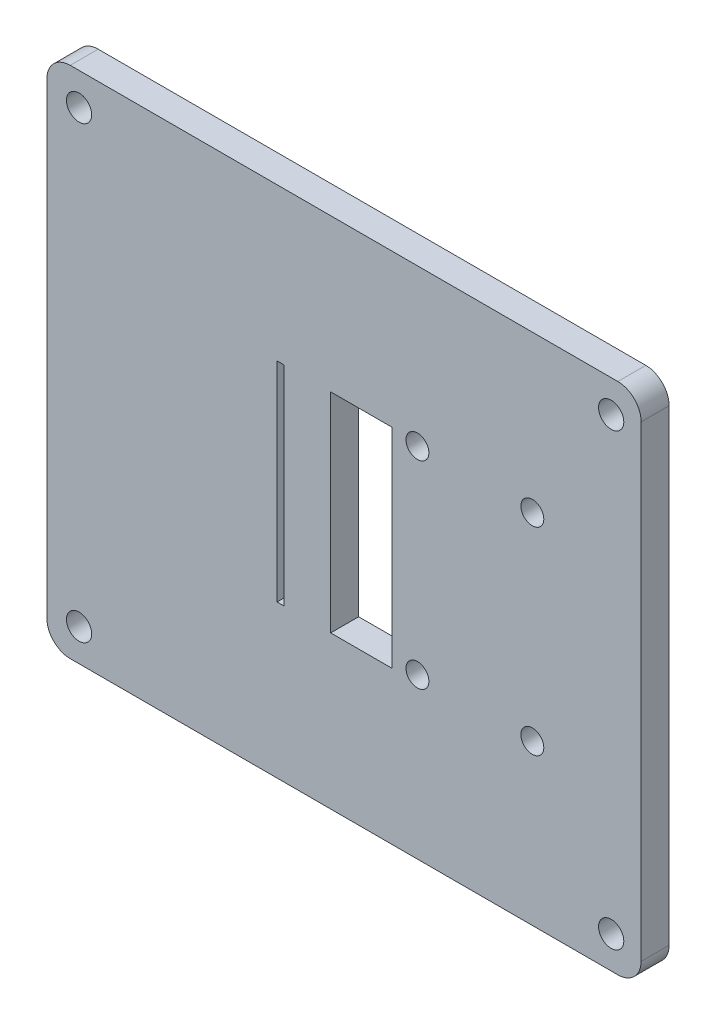
ISO-10303-21;
HEADER;
FILE_DESCRIPTION(('STEP AP214'),'2;1');
FILE_NAME('part.step','',(''),(''),'','','');
FILE_SCHEMA(('AUTOMOTIVE_DESIGN { 1 0 10303 214 1 1 1 1 }'));
ENDSEC;
DATA;
#1=APPLICATION_CONTEXT('core data for automotive mechanical design processes');
#2=APPLICATION_PROTOCOL_DEFINITION('international standard','automotive_design',2000,#1);
#3=PRODUCT_CONTEXT('',#1,'mechanical');
#4=PRODUCT('Part','Part','',(#3));
#5=PRODUCT_RELATED_PRODUCT_CATEGORY('part','',(#4));
#6=PRODUCT_DEFINITION_FORMATION('','',#4);
#7=PRODUCT_DEFINITION_CONTEXT('part definition',#1,'design');
#8=PRODUCT_DEFINITION('design','',#6,#7);
#9=PRODUCT_DEFINITION_SHAPE('','',#8);
#10=(LENGTH_UNIT() NAMED_UNIT(*) SI_UNIT(.MILLI.,.METRE.));
#11=(NAMED_UNIT(*) PLANE_ANGLE_UNIT() SI_UNIT($,.RADIAN.));
#12=(NAMED_UNIT(*) SI_UNIT($,.STERADIAN.) SOLID_ANGLE_UNIT());
#13=UNCERTAINTY_MEASURE_WITH_UNIT(LENGTH_MEASURE(1.E-05),#10,'distance_accuracy_value','');
#14=(GEOMETRIC_REPRESENTATION_CONTEXT(3) GLOBAL_UNCERTAINTY_ASSIGNED_CONTEXT((#13)) GLOBAL_UNIT_ASSIGNED_CONTEXT((#10,
#11,#12)) REPRESENTATION_CONTEXT('',''));
#15=CARTESIAN_POINT('',(0.,0.,0.));
#16=DIRECTION('',(0.,0.,1.));
#17=DIRECTION('',(1.,0.,0.));
#18=AXIS2_PLACEMENT_3D('',#15,#16,#17);
#19=CARTESIAN_POINT('',(60.10036367,12.48963974,-3.048));
#20=DIRECTION('',(0.,0.,1.));
#21=DIRECTION('',(1.,0.,0.));
#22=AXIS2_PLACEMENT_3D('',#19,#20,#21);
#23=CYLINDRICAL_SURFACE('',#22,2.54);
#24=CARTESIAN_POINT('',(60.10036367,12.48963974,0.));
#25=DIRECTION('',(0.,0.,1.));
#26=DIRECTION('',(-1.,0.,0.));
#27=AXIS2_PLACEMENT_3D('',#24,#25,#26);
#28=CIRCLE('',#27,2.54);
#29=CARTESIAN_POINT('',(62.64036367,12.48963974,0.));
#30=VERTEX_POINT('',#29);
#31=CARTESIAN_POINT('',(60.10036367,15.02963974,0.));
#32=VERTEX_POINT('',#31);
#33=EDGE_CURVE('E260',#30,#32,#28,.T.);
#34=ORIENTED_EDGE('',*,*,#33,.F.);
#35=DIRECTION('',(0.,0.,1.));
#36=VECTOR('',#35,1.);
#37=CARTESIAN_POINT('',(62.64036367,12.48963974,-3.048));
#38=LINE('',#37,#36);
#39=CARTESIAN_POINT('',(62.64036367,12.48963974,-3.048));
#40=VERTEX_POINT('',#39);
#41=EDGE_CURVE('E11',#40,#30,#38,.T.);
#42=ORIENTED_EDGE('',*,*,#41,.F.);
#43=CARTESIAN_POINT('',(60.10036367,12.48963974,-3.048));
#44=DIRECTION('',(0.,0.,1.));
#45=DIRECTION('',(-1.,0.,0.));
#46=AXIS2_PLACEMENT_3D('',#43,#44,#45);
#47=CIRCLE('',#46,2.54);
#48=CARTESIAN_POINT('',(60.10036367,15.02963974,-3.048));
#49=VERTEX_POINT('',#48);
#50=EDGE_CURVE('E263',#40,#49,#47,.T.);
#51=ORIENTED_EDGE('',*,*,#50,.T.);
#52=DIRECTION('',(0.,0.,1.));
#53=VECTOR('',#52,1.);
#54=CARTESIAN_POINT('',(60.10036367,15.02963974,-3.048));
#55=LINE('',#54,#53);
#56=EDGE_CURVE('E36',#49,#32,#55,.T.);
#57=ORIENTED_EDGE('',*,*,#56,.T.);
#58=EDGE_LOOP('',(#34,#42,#51,#57));
#59=FACE_BOUND('',#58,.T.);
#60=ADVANCED_FACE('F33',(#59),#23,.T.);
#61=CARTESIAN_POINT('',(62.64036367,12.48963974,-3.048));
#62=DIRECTION('',(1.,0.,0.));
#63=DIRECTION('',(0.,1.,0.));
#64=AXIS2_PLACEMENT_3D('',#61,#62,#63);
#65=PLANE('',#64);
#66=DIRECTION('',(0.,1.,0.));
#67=VECTOR('',#66,1.);
#68=CARTESIAN_POINT('',(62.64036367,12.48963974,0.));
#69=LINE('',#68,#67);
#70=CARTESIAN_POINT('',(62.64036367,-38.4396361,0.));
#71=VERTEX_POINT('',#70);
#72=EDGE_CURVE('E267',#71,#30,#69,.T.);
#73=ORIENTED_EDGE('',*,*,#72,.F.);
#74=DIRECTION('',(0.,0.,1.));
#75=VECTOR('',#74,1.);
#76=CARTESIAN_POINT('',(62.64036367,-38.4396361,-3.048));
#77=LINE('',#76,#75);
#78=CARTESIAN_POINT('',(62.64036367,-38.4396361,-3.048));
#79=VERTEX_POINT('',#78);
#80=EDGE_CURVE('E41',#79,#71,#77,.T.);
#81=ORIENTED_EDGE('',*,*,#80,.F.);
#82=DIRECTION('',(0.,1.,0.));
#83=VECTOR('',#82,1.);
#84=CARTESIAN_POINT('',(62.64036367,12.48963974,-3.048));
#85=LINE('',#84,#83);
#86=EDGE_CURVE('E285',#79,#40,#85,.T.);
#87=ORIENTED_EDGE('',*,*,#86,.T.);
#88=ORIENTED_EDGE('',*,*,#41,.T.);
#89=EDGE_LOOP('',(#73,#81,#87,#88));
#90=FACE_BOUND('',#89,.T.);
#91=ADVANCED_FACE('F332',(#90),#65,.T.);
#92=CARTESIAN_POINT('',(60.10036367,-38.4396361,-3.048));
#93=DIRECTION('',(0.,0.,1.));
#94=DIRECTION('',(1.,0.,0.));
#95=AXIS2_PLACEMENT_3D('',#92,#93,#94);
#96=CYLINDRICAL_SURFACE('',#95,2.54);
#97=CARTESIAN_POINT('',(60.10036367,-38.4396361,0.));
#98=DIRECTION('',(0.,0.,1.));
#99=DIRECTION('',(-1.,0.,0.));
#100=AXIS2_PLACEMENT_3D('',#97,#98,#99);
#101=CIRCLE('',#100,2.54);
#102=CARTESIAN_POINT('',(60.10036367,-40.9796361,0.));
#103=VERTEX_POINT('',#102);
#104=EDGE_CURVE('E305',#103,#71,#101,.T.);
#105=ORIENTED_EDGE('',*,*,#104,.F.);
#106=DIRECTION('',(0.,0.,1.));
#107=VECTOR('',#106,1.);
#108=CARTESIAN_POINT('',(60.10036367,-40.9796361,-3.048));
#109=LINE('',#108,#107);
#110=CARTESIAN_POINT('',(60.10036367,-40.9796361,-3.048));
#111=VERTEX_POINT('',#110);
#112=EDGE_CURVE('E311',#111,#103,#109,.T.);
#113=ORIENTED_EDGE('',*,*,#112,.F.);
#114=CARTESIAN_POINT('',(60.10036367,-38.4396361,-3.048));
#115=DIRECTION('',(0.,0.,1.));
#116=DIRECTION('',(-1.,0.,0.));
#117=AXIS2_PLACEMENT_3D('',#114,#115,#116);
#118=CIRCLE('',#117,2.54);
#119=EDGE_CURVE('E282',#111,#79,#118,.T.);
#120=ORIENTED_EDGE('',*,*,#119,.T.);
#121=ORIENTED_EDGE('',*,*,#80,.T.);
#122=EDGE_LOOP('',(#105,#113,#120,#121));
#123=FACE_BOUND('',#122,.T.);
#124=ADVANCED_FACE('F352',(#123),#96,.T.);
#125=CARTESIAN_POINT('',(0.41036367000002,-40.9796361,-3.048));
#126=DIRECTION('',(0.,-1.,0.));
#127=DIRECTION('',(1.,0.,0.));
#128=AXIS2_PLACEMENT_3D('',#125,#126,#127);
#129=PLANE('',#128);
#130=DIRECTION('',(1.,0.,0.));
#131=VECTOR('',#130,1.);
#132=CARTESIAN_POINT('',(0.41036367000002,-40.9796361,0.));
#133=LINE('',#132,#131);
#134=CARTESIAN_POINT('',(0.410363670000021,-40.9796361,0.));
#135=VERTEX_POINT('',#134);
#136=EDGE_CURVE('E302',#135,#103,#133,.T.);
#137=ORIENTED_EDGE('',*,*,#136,.F.);
#138=DIRECTION('',(0.,0.,1.));
#139=VECTOR('',#138,1.);
#140=CARTESIAN_POINT('',(0.410363670000021,-40.9796361,-3.048));
#141=LINE('',#140,#139);
#142=CARTESIAN_POINT('',(0.410363670000021,-40.9796361,-3.048));
#143=VERTEX_POINT('',#142);
#144=EDGE_CURVE('E313',#143,#135,#141,.T.);
#145=ORIENTED_EDGE('',*,*,#144,.F.);
#146=DIRECTION('',(1.,0.,0.));
#147=VECTOR('',#146,1.);
#148=CARTESIAN_POINT('',(0.41036367000002,-40.9796361,-3.048));
#149=LINE('',#148,#147);
#150=EDGE_CURVE('E279',#143,#111,#149,.T.);
#151=ORIENTED_EDGE('',*,*,#150,.T.);
#152=ORIENTED_EDGE('',*,*,#112,.T.);
#153=EDGE_LOOP('',(#137,#145,#151,#152));
#154=FACE_BOUND('',#153,.T.);
#155=ADVANCED_FACE('F350',(#154),#129,.T.);
#156=CARTESIAN_POINT('',(0.410363670000002,-38.4396361,-3.048));
#157=DIRECTION('',(0.,0.,1.));
#158=DIRECTION('',(1.,0.,0.));
#159=AXIS2_PLACEMENT_3D('',#156,#157,#158);
#160=CYLINDRICAL_SURFACE('',#159,2.54);
#161=CARTESIAN_POINT('',(0.410363670000002,-38.4396361,0.));
#162=DIRECTION('',(0.,0.,1.));
#163=DIRECTION('',(-1.,0.,0.));
#164=AXIS2_PLACEMENT_3D('',#161,#162,#163);
#165=CIRCLE('',#164,2.54);
#166=CARTESIAN_POINT('',(-2.12963633,-38.4396361,0.));
#167=VERTEX_POINT('',#166);
#168=EDGE_CURVE('E299',#167,#135,#165,.T.);
#169=ORIENTED_EDGE('',*,*,#168,.F.);
#170=DIRECTION('',(0.,0.,1.));
#171=VECTOR('',#170,1.);
#172=CARTESIAN_POINT('',(-2.12963633,-38.4396361,-3.048));
#173=LINE('',#172,#171);
#174=CARTESIAN_POINT('',(-2.12963633,-38.4396361,-3.048));
#175=VERTEX_POINT('',#174);
#176=EDGE_CURVE('E315',#175,#167,#173,.T.);
#177=ORIENTED_EDGE('',*,*,#176,.F.);
#178=CARTESIAN_POINT('',(0.410363670000002,-38.4396361,-3.048));
#179=DIRECTION('',(0.,0.,1.));
#180=DIRECTION('',(-1.,0.,0.));
#181=AXIS2_PLACEMENT_3D('',#178,#179,#180);
#182=CIRCLE('',#181,2.54);
#183=EDGE_CURVE('E276',#175,#143,#182,.T.);
#184=ORIENTED_EDGE('',*,*,#183,.T.);
#185=ORIENTED_EDGE('',*,*,#144,.T.);
#186=EDGE_LOOP('',(#169,#177,#184,#185));
#187=FACE_BOUND('',#186,.T.);
#188=ADVANCED_FACE('F346',(#187),#160,.T.);
#189=CARTESIAN_POINT('',(-2.12963633,12.48963974,-3.048));
#190=DIRECTION('',(-1.,0.,0.));
#191=DIRECTION('',(0.,0.,1.));
#192=AXIS2_PLACEMENT_3D('',#189,#190,#191);
#193=PLANE('',#192);
#194=DIRECTION('',(0.,-1.,0.));
#195=VECTOR('',#194,1.);
#196=CARTESIAN_POINT('',(-2.12963633,12.48963974,0.));
#197=LINE('',#196,#195);
#198=CARTESIAN_POINT('',(-2.12963633,12.48963974,0.));
#199=VERTEX_POINT('',#198);
#200=EDGE_CURVE('E296',#199,#167,#197,.T.);
#201=ORIENTED_EDGE('',*,*,#200,.F.);
#202=DIRECTION('',(0.,0.,1.));
#203=VECTOR('',#202,1.);
#204=CARTESIAN_POINT('',(-2.12963633,12.48963974,-3.048));
#205=LINE('',#204,#203);
#206=CARTESIAN_POINT('',(-2.12963633,12.48963974,-3.048));
#207=VERTEX_POINT('',#206);
#208=EDGE_CURVE('E317',#207,#199,#205,.T.);
#209=ORIENTED_EDGE('',*,*,#208,.F.);
#210=DIRECTION('',(0.,-1.,0.));
#211=VECTOR('',#210,1.);
#212=CARTESIAN_POINT('',(-2.12963633,12.48963974,-3.048));
#213=LINE('',#212,#211);
#214=EDGE_CURVE('E273',#207,#175,#213,.T.);
#215=ORIENTED_EDGE('',*,*,#214,.T.);
#216=ORIENTED_EDGE('',*,*,#176,.T.);
#217=EDGE_LOOP('',(#201,#209,#215,#216));
#218=FACE_BOUND('',#217,.T.);
#219=ADVANCED_FACE('F344',(#218),#193,.T.);
#220=CARTESIAN_POINT('',(0.410363670000002,12.48963974,-3.048));
#221=DIRECTION('',(0.,0.,1.));
#222=DIRECTION('',(1.,0.,0.));
#223=AXIS2_PLACEMENT_3D('',#220,#221,#222);
#224=CYLINDRICAL_SURFACE('',#223,2.54);
#225=CARTESIAN_POINT('',(0.410363670000002,12.48963974,0.));
#226=DIRECTION('',(0.,0.,1.));
#227=DIRECTION('',(-1.,0.,0.));
#228=AXIS2_PLACEMENT_3D('',#225,#226,#227);
#229=CIRCLE('',#228,2.54);
#230=CARTESIAN_POINT('',(0.41036367000002,15.02963974,0.));
#231=VERTEX_POINT('',#230);
#232=EDGE_CURVE('E293',#231,#199,#229,.T.);
#233=ORIENTED_EDGE('',*,*,#232,.F.);
#234=DIRECTION('',(0.,0.,1.));
#235=VECTOR('',#234,1.);
#236=CARTESIAN_POINT('',(0.41036367000002,15.02963974,-3.048));
#237=LINE('',#236,#235);
#238=CARTESIAN_POINT('',(0.41036367000002,15.02963974,-3.048));
#239=VERTEX_POINT('',#238);
#240=EDGE_CURVE('E318',#239,#231,#237,.T.);
#241=ORIENTED_EDGE('',*,*,#240,.F.);
#242=CARTESIAN_POINT('',(0.410363670000002,12.48963974,-3.048));
#243=DIRECTION('',(0.,0.,1.));
#244=DIRECTION('',(-1.,0.,0.));
#245=AXIS2_PLACEMENT_3D('',#242,#243,#244);
#246=CIRCLE('',#245,2.54);
#247=EDGE_CURVE('E270',#239,#207,#246,.T.);
#248=ORIENTED_EDGE('',*,*,#247,.T.);
#249=ORIENTED_EDGE('',*,*,#208,.T.);
#250=EDGE_LOOP('',(#233,#241,#248,#249));
#251=FACE_BOUND('',#250,.T.);
#252=ADVANCED_FACE('F340',(#251),#224,.T.);
#253=CARTESIAN_POINT('',(0.41036367000002,15.02963974,-3.048));
#254=DIRECTION('',(0.,1.,0.));
#255=DIRECTION('',(0.,0.,1.));
#256=AXIS2_PLACEMENT_3D('',#253,#254,#255);
#257=PLANE('',#256);
#258=DIRECTION('',(-1.,0.,0.));
#259=VECTOR('',#258,1.);
#260=CARTESIAN_POINT('',(0.41036367000002,15.02963974,0.));
#261=LINE('',#260,#259);
#262=EDGE_CURVE('E290',#32,#231,#261,.T.);
#263=ORIENTED_EDGE('',*,*,#262,.F.);
#264=ORIENTED_EDGE('',*,*,#56,.F.);
#265=DIRECTION('',(-1.,0.,0.));
#266=VECTOR('',#265,1.);
#267=CARTESIAN_POINT('',(0.41036367000002,15.02963974,-3.048));
#268=LINE('',#267,#266);
#269=EDGE_CURVE('E266',#49,#239,#268,.T.);
#270=ORIENTED_EDGE('',*,*,#269,.T.);
#271=ORIENTED_EDGE('',*,*,#240,.T.);
#272=EDGE_LOOP('',(#263,#264,#270,#271));
#273=FACE_BOUND('',#272,.T.);
#274=ADVANCED_FACE('F326',(#273),#257,.T.);
#275=CARTESIAN_POINT('',(60.10036367,12.48963974,-3.048));
#276=DIRECTION('',(0.,0.,-1.));
#277=DIRECTION('',(-1.,0.,0.));
#278=AXIS2_PLACEMENT_3D('',#275,#276,#277);
#279=PLANE('',#278);
#280=DIRECTION('',(0.,1.,0.));
#281=VECTOR('',#280,1.);
#282=CARTESIAN_POINT('',(23.72146367,-24.35209818,-3.048));
#283=LINE('',#282,#281);
#284=CARTESIAN_POINT('',(23.72146367,-24.35209818,-3.048));
#285=VERTEX_POINT('',#284);
#286=CARTESIAN_POINT('',(23.72146367,-1.59789817999999,-3.048));
#287=VERTEX_POINT('',#286);
#288=EDGE_CURVE('E148',#285,#287,#283,.T.);
#289=ORIENTED_EDGE('',*,*,#288,.T.);
#290=DIRECTION('',(-1.,0.,0.));
#291=VECTOR('',#290,1.);
#292=CARTESIAN_POINT('',(22.95946367,-1.59789817999999,-3.048));
#293=LINE('',#292,#291);
#294=CARTESIAN_POINT('',(22.95946367,-1.59789817999999,-3.048));
#295=VERTEX_POINT('',#294);
#296=EDGE_CURVE('E157',#287,#295,#293,.T.);
#297=ORIENTED_EDGE('',*,*,#296,.T.);
#298=DIRECTION('',(0.,-1.,0.));
#299=VECTOR('',#298,1.);
#300=CARTESIAN_POINT('',(22.95946367,-24.35209818,-3.048));
#301=LINE('',#300,#299);
#302=CARTESIAN_POINT('',(22.95946367,-24.35209818,-3.048));
#303=VERTEX_POINT('',#302);
#304=EDGE_CURVE('E49',#295,#303,#301,.T.);
#305=ORIENTED_EDGE('',*,*,#304,.T.);
#306=DIRECTION('',(1.,0.,0.));
#307=VECTOR('',#306,1.);
#308=CARTESIAN_POINT('',(22.95946367,-24.35209818,-3.048));
#309=LINE('',#308,#307);
#310=EDGE_CURVE('E154',#303,#285,#309,.T.);
#311=ORIENTED_EDGE('',*,*,#310,.T.);
#312=EDGE_LOOP('',(#289,#297,#305,#311));
#313=FACE_BOUND('',#312,.T.);
#314=CARTESIAN_POINT('',(38.25636367,-23.57459818,-3.048));
#315=DIRECTION('',(0.,0.,1.));
#316=DIRECTION('',(1.,0.,0.));
#317=AXIS2_PLACEMENT_3D('',#314,#315,#316);
#318=CIRCLE('',#317,1.24999999999997);
#319=CARTESIAN_POINT('',(39.50636367,-23.57459818,-3.048));
#320=VERTEX_POINT('',#319);
#321=EDGE_CURVE('E183',#320,#320,#318,.T.);
#322=ORIENTED_EDGE('',*,*,#321,.T.);
#323=EDGE_LOOP('',(#322));
#324=FACE_BOUND('',#323,.T.);
#325=CARTESIAN_POINT('',(50.77996367,-23.57459818,-3.048));
#326=DIRECTION('',(0.,0.,1.));
#327=DIRECTION('',(1.,0.,0.));
#328=AXIS2_PLACEMENT_3D('',#325,#326,#327);
#329=CIRCLE('',#328,1.24999999999997);
#330=CARTESIAN_POINT('',(52.02996367,-23.57459818,-3.048));
#331=VERTEX_POINT('',#330);
#332=EDGE_CURVE('E189',#331,#331,#329,.T.);
#333=ORIENTED_EDGE('',*,*,#332,.T.);
#334=EDGE_LOOP('',(#333));
#335=FACE_BOUND('',#334,.T.);
#336=CARTESIAN_POINT('',(50.77996367,-2.00169817999996,-3.048));
#337=DIRECTION('',(0.,0.,1.));
#338=DIRECTION('',(1.,0.,0.));
#339=AXIS2_PLACEMENT_3D('',#336,#337,#338);
#340=CIRCLE('',#339,1.24999999999997);
#341=CARTESIAN_POINT('',(52.02996367,-2.00169817999996,-3.048));
#342=VERTEX_POINT('',#341);
#343=EDGE_CURVE('E195',#342,#342,#340,.T.);
#344=ORIENTED_EDGE('',*,*,#343,.T.);
#345=EDGE_LOOP('',(#344));
#346=FACE_BOUND('',#345,.T.);
#347=CARTESIAN_POINT('',(38.25636367,-2.00169817999996,-3.048));
#348=DIRECTION('',(0.,0.,1.));
#349=DIRECTION('',(1.,0.,0.));
#350=AXIS2_PLACEMENT_3D('',#347,#348,#349);
#351=CIRCLE('',#350,1.24999999999997);
#352=CARTESIAN_POINT('',(39.50636367,-2.00169817999996,-3.048));
#353=VERTEX_POINT('',#352);
#354=EDGE_CURVE('E201',#353,#353,#351,.T.);
#355=ORIENTED_EDGE('',*,*,#354,.T.);
#356=EDGE_LOOP('',(#355));
#357=FACE_BOUND('',#356,.T.);
#358=DIRECTION('',(0.,-1.,0.));
#359=VECTOR('',#358,1.);
#360=CARTESIAN_POINT('',(28.80146367,-24.35209818,-3.048));
#361=LINE('',#360,#359);
#362=CARTESIAN_POINT('',(28.80146367,-1.59789818,-3.048));
#363=VERTEX_POINT('',#362);
#364=CARTESIAN_POINT('',(28.80146367,-24.35209818,-3.048));
#365=VERTEX_POINT('',#364);
#366=EDGE_CURVE('E207',#363,#365,#361,.T.);
#367=ORIENTED_EDGE('',*,*,#366,.T.);
#368=DIRECTION('',(1.,0.,0.));
#369=VECTOR('',#368,1.);
#370=CARTESIAN_POINT('',(28.80146367,-24.35209818,-3.048));
#371=LINE('',#370,#369);
#372=CARTESIAN_POINT('',(35.50146367,-24.35209818,-3.048));
#373=VERTEX_POINT('',#372);
#374=EDGE_CURVE('E210',#365,#373,#371,.T.);
#375=ORIENTED_EDGE('',*,*,#374,.T.);
#376=DIRECTION('',(0.,1.,0.));
#377=VECTOR('',#376,1.);
#378=CARTESIAN_POINT('',(35.50146367,-24.35209818,-3.048));
#379=LINE('',#378,#377);
#380=CARTESIAN_POINT('',(35.50146367,-1.59789818000002,-3.048));
#381=VERTEX_POINT('',#380);
#382=EDGE_CURVE('E214',#373,#381,#379,.T.);
#383=ORIENTED_EDGE('',*,*,#382,.T.);
#384=DIRECTION('',(-1.,0.,0.));
#385=VECTOR('',#384,1.);
#386=CARTESIAN_POINT('',(28.80146367,-1.59789818,-3.048));
#387=LINE('',#386,#385);
#388=EDGE_CURVE('E217',#381,#363,#387,.T.);
#389=ORIENTED_EDGE('',*,*,#388,.T.);
#390=EDGE_LOOP('',(#367,#375,#383,#389));
#391=FACE_BOUND('',#390,.T.);
#392=CARTESIAN_POINT('',(1.37500106,-37.47499998,-3.048));
#393=DIRECTION('',(0.,0.,1.));
#394=DIRECTION('',(1.,0.,0.));
#395=AXIS2_PLACEMENT_3D('',#392,#393,#394);
#396=CIRCLE('',#395,1.37499852);
#397=CARTESIAN_POINT('',(2.74999958,-37.47499998,-3.048));
#398=VERTEX_POINT('',#397);
#399=EDGE_CURVE('E239',#398,#398,#396,.T.);
#400=ORIENTED_EDGE('',*,*,#399,.T.);
#401=EDGE_LOOP('',(#400));
#402=FACE_BOUND('',#401,.T.);
#403=CARTESIAN_POINT('',(59.3750019,-37.47499998,-3.048));
#404=DIRECTION('',(0.,0.,1.));
#405=DIRECTION('',(1.,0.,0.));
#406=AXIS2_PLACEMENT_3D('',#403,#404,#405);
#407=CIRCLE('',#406,1.37499852);
#408=CARTESIAN_POINT('',(60.75000042,-37.47499998,-3.048));
#409=VERTEX_POINT('',#408);
#410=EDGE_CURVE('E245',#409,#409,#407,.T.);
#411=ORIENTED_EDGE('',*,*,#410,.T.);
#412=EDGE_LOOP('',(#411));
#413=FACE_BOUND('',#412,.T.);
#414=CARTESIAN_POINT('',(59.3750019,11.52500108,-3.048));
#415=DIRECTION('',(0.,0.,1.));
#416=DIRECTION('',(1.,0.,0.));
#417=AXIS2_PLACEMENT_3D('',#414,#415,#416);
#418=CIRCLE('',#417,1.37499852);
#419=CARTESIAN_POINT('',(60.75000042,11.52500108,-3.048));
#420=VERTEX_POINT('',#419);
#421=EDGE_CURVE('E251',#420,#420,#418,.T.);
#422=ORIENTED_EDGE('',*,*,#421,.T.);
#423=EDGE_LOOP('',(#422));
#424=FACE_BOUND('',#423,.T.);
#425=CARTESIAN_POINT('',(1.37500106,11.52500108,-3.048));
#426=DIRECTION('',(0.,0.,1.));
#427=DIRECTION('',(1.,0.,0.));
#428=AXIS2_PLACEMENT_3D('',#425,#426,#427);
#429=CIRCLE('',#428,1.37499852);
#430=CARTESIAN_POINT('',(2.74999958,11.52500108,-3.048));
#431=VERTEX_POINT('',#430);
#432=EDGE_CURVE('E257',#431,#431,#429,.T.);
#433=ORIENTED_EDGE('',*,*,#432,.T.);
#434=EDGE_LOOP('',(#433));
#435=FACE_BOUND('',#434,.T.);
#436=ORIENTED_EDGE('',*,*,#50,.F.);
#437=ORIENTED_EDGE('',*,*,#86,.F.);
#438=ORIENTED_EDGE('',*,*,#119,.F.);
#439=ORIENTED_EDGE('',*,*,#150,.F.);
#440=ORIENTED_EDGE('',*,*,#183,.F.);
#441=ORIENTED_EDGE('',*,*,#214,.F.);
#442=ORIENTED_EDGE('',*,*,#247,.F.);
#443=ORIENTED_EDGE('',*,*,#269,.F.);
#444=EDGE_LOOP('',(#436,#437,#438,#439,#440,#441,#442,#443));
#445=FACE_BOUND('',#444,.T.);
#446=ADVANCED_FACE('F161',(#313,#324,#335,#346,#357,#391,#402,#413,#424,#435,#445),#279,.T.);
#447=CARTESIAN_POINT('',(60.10036367,12.48963974,0.));
#448=DIRECTION('',(0.,0.,-1.));
#449=DIRECTION('',(-1.,0.,0.));
#450=AXIS2_PLACEMENT_3D('',#447,#448,#449);
#451=PLANE('',#450);
#452=DIRECTION('',(-1.,0.,0.));
#453=VECTOR('',#452,1.);
#454=CARTESIAN_POINT('',(22.95946367,-1.59789817999999,0.));
#455=LINE('',#454,#453);
#456=CARTESIAN_POINT('',(23.72146367,-1.59789817999999,0.));
#457=VERTEX_POINT('',#456);
#458=CARTESIAN_POINT('',(22.95946367,-1.59789817999999,0.));
#459=VERTEX_POINT('',#458);
#460=EDGE_CURVE('E173',#457,#459,#455,.T.);
#461=ORIENTED_EDGE('',*,*,#460,.F.);
#462=DIRECTION('',(0.,1.,0.));
#463=VECTOR('',#462,1.);
#464=CARTESIAN_POINT('',(23.72146367,-24.35209818,0.));
#465=LINE('',#464,#463);
#466=CARTESIAN_POINT('',(23.72146367,-24.35209818,0.));
#467=VERTEX_POINT('',#466);
#468=EDGE_CURVE('E57',#467,#457,#465,.T.);
#469=ORIENTED_EDGE('',*,*,#468,.F.);
#470=DIRECTION('',(1.,0.,0.));
#471=VECTOR('',#470,1.);
#472=CARTESIAN_POINT('',(22.95946367,-24.35209818,0.));
#473=LINE('',#472,#471);
#474=CARTESIAN_POINT('',(22.95946367,-24.35209818,0.));
#475=VERTEX_POINT('',#474);
#476=EDGE_CURVE('E164',#475,#467,#473,.T.);
#477=ORIENTED_EDGE('',*,*,#476,.F.);
#478=DIRECTION('',(0.,-1.,0.));
#479=VECTOR('',#478,1.);
#480=CARTESIAN_POINT('',(22.95946367,-24.35209818,0.));
#481=LINE('',#480,#479);
#482=EDGE_CURVE('E167',#459,#475,#481,.T.);
#483=ORIENTED_EDGE('',*,*,#482,.F.);
#484=EDGE_LOOP('',(#461,#469,#477,#483));
#485=FACE_BOUND('',#484,.T.);
#486=CARTESIAN_POINT('',(38.25636367,-23.57459818,0.));
#487=DIRECTION('',(0.,0.,1.));
#488=DIRECTION('',(1.,0.,0.));
#489=AXIS2_PLACEMENT_3D('',#486,#487,#488);
#490=CIRCLE('',#489,1.24999999999997);
#491=CARTESIAN_POINT('',(39.50636367,-23.57459818,0.));
#492=VERTEX_POINT('',#491);
#493=EDGE_CURVE('E179',#492,#492,#490,.T.);
#494=ORIENTED_EDGE('',*,*,#493,.F.);
#495=EDGE_LOOP('',(#494));
#496=FACE_BOUND('',#495,.T.);
#497=CARTESIAN_POINT('',(50.77996367,-23.57459818,0.));
#498=DIRECTION('',(0.,0.,1.));
#499=DIRECTION('',(1.,0.,0.));
#500=AXIS2_PLACEMENT_3D('',#497,#498,#499);
#501=CIRCLE('',#500,1.24999999999997);
#502=CARTESIAN_POINT('',(52.02996367,-23.57459818,0.));
#503=VERTEX_POINT('',#502);
#504=EDGE_CURVE('E186',#503,#503,#501,.T.);
#505=ORIENTED_EDGE('',*,*,#504,.F.);
#506=EDGE_LOOP('',(#505));
#507=FACE_BOUND('',#506,.T.);
#508=CARTESIAN_POINT('',(50.77996367,-2.00169817999996,0.));
#509=DIRECTION('',(0.,0.,1.));
#510=DIRECTION('',(1.,0.,0.));
#511=AXIS2_PLACEMENT_3D('',#508,#509,#510);
#512=CIRCLE('',#511,1.24999999999997);
#513=CARTESIAN_POINT('',(52.02996367,-2.00169817999996,0.));
#514=VERTEX_POINT('',#513);
#515=EDGE_CURVE('E192',#514,#514,#512,.T.);
#516=ORIENTED_EDGE('',*,*,#515,.F.);
#517=EDGE_LOOP('',(#516));
#518=FACE_BOUND('',#517,.T.);
#519=CARTESIAN_POINT('',(38.25636367,-2.00169817999996,0.));
#520=DIRECTION('',(0.,0.,1.));
#521=DIRECTION('',(1.,0.,0.));
#522=AXIS2_PLACEMENT_3D('',#519,#520,#521);
#523=CIRCLE('',#522,1.24999999999997);
#524=CARTESIAN_POINT('',(39.50636367,-2.00169817999996,0.));
#525=VERTEX_POINT('',#524);
#526=EDGE_CURVE('E198',#525,#525,#523,.T.);
#527=ORIENTED_EDGE('',*,*,#526,.F.);
#528=EDGE_LOOP('',(#527));
#529=FACE_BOUND('',#528,.T.);
#530=DIRECTION('',(1.,0.,0.));
#531=VECTOR('',#530,1.);
#532=CARTESIAN_POINT('',(28.80146367,-24.35209818,0.));
#533=LINE('',#532,#531);
#534=CARTESIAN_POINT('',(28.80146367,-24.35209818,0.));
#535=VERTEX_POINT('',#534);
#536=CARTESIAN_POINT('',(35.50146367,-24.35209818,0.));
#537=VERTEX_POINT('',#536);
#538=EDGE_CURVE('E222',#535,#537,#533,.T.);
#539=ORIENTED_EDGE('',*,*,#538,.F.);
#540=DIRECTION('',(0.,-1.,0.));
#541=VECTOR('',#540,1.);
#542=CARTESIAN_POINT('',(28.80146367,-24.35209818,0.));
#543=LINE('',#542,#541);
#544=CARTESIAN_POINT('',(28.80146367,-1.59789818,0.));
#545=VERTEX_POINT('',#544);
#546=EDGE_CURVE('E204',#545,#535,#543,.T.);
#547=ORIENTED_EDGE('',*,*,#546,.F.);
#548=DIRECTION('',(-1.,0.,0.));
#549=VECTOR('',#548,1.);
#550=CARTESIAN_POINT('',(28.80146367,-1.59789818,0.));
#551=LINE('',#550,#549);
#552=CARTESIAN_POINT('',(35.50146367,-1.59789818000002,0.));
#553=VERTEX_POINT('',#552);
#554=EDGE_CURVE('E211',#553,#545,#551,.T.);
#555=ORIENTED_EDGE('',*,*,#554,.F.);
#556=DIRECTION('',(0.,1.,0.));
#557=VECTOR('',#556,1.);
#558=CARTESIAN_POINT('',(35.50146367,-24.35209818,0.));
#559=LINE('',#558,#557);
#560=EDGE_CURVE('E225',#537,#553,#559,.T.);
#561=ORIENTED_EDGE('',*,*,#560,.F.);
#562=EDGE_LOOP('',(#539,#547,#555,#561));
#563=FACE_BOUND('',#562,.T.);
#564=CARTESIAN_POINT('',(1.37500106,-37.47499998,0.));
#565=DIRECTION('',(0.,0.,1.));
#566=DIRECTION('',(1.,0.,0.));
#567=AXIS2_PLACEMENT_3D('',#564,#565,#566);
#568=CIRCLE('',#567,1.37499852);
#569=CARTESIAN_POINT('',(2.74999958,-37.47499998,0.));
#570=VERTEX_POINT('',#569);
#571=EDGE_CURVE('E232',#570,#570,#568,.T.);
#572=ORIENTED_EDGE('',*,*,#571,.F.);
#573=EDGE_LOOP('',(#572));
#574=FACE_BOUND('',#573,.T.);
#575=CARTESIAN_POINT('',(59.3750019,-37.47499998,0.));
#576=DIRECTION('',(0.,0.,1.));
#577=DIRECTION('',(1.,0.,0.));
#578=AXIS2_PLACEMENT_3D('',#575,#576,#577);
#579=CIRCLE('',#578,1.37499852);
#580=CARTESIAN_POINT('',(60.75000042,-37.47499998,0.));
#581=VERTEX_POINT('',#580);
#582=EDGE_CURVE('E242',#581,#581,#579,.T.);
#583=ORIENTED_EDGE('',*,*,#582,.F.);
#584=EDGE_LOOP('',(#583));
#585=FACE_BOUND('',#584,.T.);
#586=CARTESIAN_POINT('',(59.3750019,11.52500108,0.));
#587=DIRECTION('',(0.,0.,1.));
#588=DIRECTION('',(1.,0.,0.));
#589=AXIS2_PLACEMENT_3D('',#586,#587,#588);
#590=CIRCLE('',#589,1.37499852);
#591=CARTESIAN_POINT('',(60.75000042,11.52500108,0.));
#592=VERTEX_POINT('',#591);
#593=EDGE_CURVE('E248',#592,#592,#590,.T.);
#594=ORIENTED_EDGE('',*,*,#593,.F.);
#595=EDGE_LOOP('',(#594));
#596=FACE_BOUND('',#595,.T.);
#597=CARTESIAN_POINT('',(1.37500106,11.52500108,0.));
#598=DIRECTION('',(0.,0.,1.));
#599=DIRECTION('',(1.,0.,0.));
#600=AXIS2_PLACEMENT_3D('',#597,#598,#599);
#601=CIRCLE('',#600,1.37499852);
#602=CARTESIAN_POINT('',(2.74999958,11.52500108,0.));
#603=VERTEX_POINT('',#602);
#604=EDGE_CURVE('E254',#603,#603,#601,.T.);
#605=ORIENTED_EDGE('',*,*,#604,.F.);
#606=EDGE_LOOP('',(#605));
#607=FACE_BOUND('',#606,.T.);
#608=ORIENTED_EDGE('',*,*,#33,.T.);
#609=ORIENTED_EDGE('',*,*,#262,.T.);
#610=ORIENTED_EDGE('',*,*,#232,.T.);
#611=ORIENTED_EDGE('',*,*,#200,.T.);
#612=ORIENTED_EDGE('',*,*,#168,.T.);
#613=ORIENTED_EDGE('',*,*,#136,.T.);
#614=ORIENTED_EDGE('',*,*,#104,.T.);
#615=ORIENTED_EDGE('',*,*,#72,.T.);
#616=EDGE_LOOP('',(#608,#609,#610,#611,#612,#613,#614,#615));
#617=FACE_BOUND('',#616,.T.);
#618=ADVANCED_FACE('F328',(#485,#496,#507,#518,#529,#563,#574,#585,#596,#607,#617),#451,.F.);
#619=CARTESIAN_POINT('',(1.37500106,11.52500108,-3.048));
#620=DIRECTION('',(0.,0.,1.));
#621=DIRECTION('',(1.,0.,0.));
#622=AXIS2_PLACEMENT_3D('',#619,#620,#621);
#623=CYLINDRICAL_SURFACE('',#622,1.37499852);
#624=ORIENTED_EDGE('',*,*,#432,.F.);
#625=EDGE_LOOP('',(#624));
#626=FACE_BOUND('',#625,.T.);
#627=ORIENTED_EDGE('',*,*,#604,.T.);
#628=EDGE_LOOP('',(#627));
#629=FACE_BOUND('',#628,.T.);
#630=ADVANCED_FACE('F416',(#626,#629),#623,.F.);
#631=CARTESIAN_POINT('',(59.3750019,11.52500108,-3.048));
#632=DIRECTION('',(0.,0.,1.));
#633=DIRECTION('',(1.,0.,0.));
#634=AXIS2_PLACEMENT_3D('',#631,#632,#633);
#635=CYLINDRICAL_SURFACE('',#634,1.37499852);
#636=ORIENTED_EDGE('',*,*,#421,.F.);
#637=EDGE_LOOP('',(#636));
#638=FACE_BOUND('',#637,.T.);
#639=ORIENTED_EDGE('',*,*,#593,.T.);
#640=EDGE_LOOP('',(#639));
#641=FACE_BOUND('',#640,.T.);
#642=ADVANCED_FACE('F421',(#638,#641),#635,.F.);
#643=CARTESIAN_POINT('',(59.3750019,-37.47499998,-3.048));
#644=DIRECTION('',(0.,0.,1.));
#645=DIRECTION('',(1.,0.,0.));
#646=AXIS2_PLACEMENT_3D('',#643,#644,#645);
#647=CYLINDRICAL_SURFACE('',#646,1.37499852);
#648=ORIENTED_EDGE('',*,*,#410,.F.);
#649=EDGE_LOOP('',(#648));
#650=FACE_BOUND('',#649,.T.);
#651=ORIENTED_EDGE('',*,*,#582,.T.);
#652=EDGE_LOOP('',(#651));
#653=FACE_BOUND('',#652,.T.);
#654=ADVANCED_FACE('F433',(#650,#653),#647,.F.);
#655=CARTESIAN_POINT('',(1.37500106,-37.47499998,-3.048));
#656=DIRECTION('',(0.,0.,1.));
#657=DIRECTION('',(1.,0.,0.));
#658=AXIS2_PLACEMENT_3D('',#655,#656,#657);
#659=CYLINDRICAL_SURFACE('',#658,1.37499852);
#660=ORIENTED_EDGE('',*,*,#399,.F.);
#661=EDGE_LOOP('',(#660));
#662=FACE_BOUND('',#661,.T.);
#663=ORIENTED_EDGE('',*,*,#571,.T.);
#664=EDGE_LOOP('',(#663));
#665=FACE_BOUND('',#664,.T.);
#666=ADVANCED_FACE('F443',(#662,#665),#659,.F.);
#667=CARTESIAN_POINT('',(28.80146367,-24.35209818,-3.048));
#668=DIRECTION('',(-1.,0.,0.));
#669=DIRECTION('',(0.,0.,1.));
#670=AXIS2_PLACEMENT_3D('',#667,#668,#669);
#671=PLANE('',#670);
#672=ORIENTED_EDGE('',*,*,#546,.T.);
#673=DIRECTION('',(0.,0.,1.));
#674=VECTOR('',#673,1.);
#675=CARTESIAN_POINT('',(28.80146367,-24.35209818,-3.048));
#676=LINE('',#675,#674);
#677=EDGE_CURVE('E220',#365,#535,#676,.T.);
#678=ORIENTED_EDGE('',*,*,#677,.F.);
#679=ORIENTED_EDGE('',*,*,#366,.F.);
#680=DIRECTION('',(0.,0.,1.));
#681=VECTOR('',#680,1.);
#682=CARTESIAN_POINT('',(28.80146367,-1.59789818,-3.048));
#683=LINE('',#682,#681);
#684=EDGE_CURVE('E230',#363,#545,#683,.T.);
#685=ORIENTED_EDGE('',*,*,#684,.T.);
#686=EDGE_LOOP('',(#672,#678,#679,#685));
#687=FACE_BOUND('',#686,.T.);
#688=ADVANCED_FACE('F453',(#687),#671,.F.);
#689=CARTESIAN_POINT('',(28.80146367,-1.59789818,-3.048));
#690=DIRECTION('',(0.,1.,0.));
#691=DIRECTION('',(-1.,0.,0.));
#692=AXIS2_PLACEMENT_3D('',#689,#690,#691);
#693=PLANE('',#692);
#694=ORIENTED_EDGE('',*,*,#554,.T.);
#695=ORIENTED_EDGE('',*,*,#684,.F.);
#696=ORIENTED_EDGE('',*,*,#388,.F.);
#697=DIRECTION('',(0.,0.,1.));
#698=VECTOR('',#697,1.);
#699=CARTESIAN_POINT('',(35.50146367,-1.59789818000002,-3.048));
#700=LINE('',#699,#698);
#701=EDGE_CURVE('E233',#381,#553,#700,.T.);
#702=ORIENTED_EDGE('',*,*,#701,.T.);
#703=EDGE_LOOP('',(#694,#695,#696,#702));
#704=FACE_BOUND('',#703,.T.);
#705=ADVANCED_FACE('F476',(#704),#693,.F.);
#706=CARTESIAN_POINT('',(35.50146367,-24.35209818,-3.048));
#707=DIRECTION('',(1.,0.,0.));
#708=DIRECTION('',(0.,0.,-1.));
#709=AXIS2_PLACEMENT_3D('',#706,#707,#708);
#710=PLANE('',#709);
#711=ORIENTED_EDGE('',*,*,#560,.T.);
#712=ORIENTED_EDGE('',*,*,#701,.F.);
#713=ORIENTED_EDGE('',*,*,#382,.F.);
#714=DIRECTION('',(0.,0.,1.));
#715=VECTOR('',#714,1.);
#716=CARTESIAN_POINT('',(35.50146367,-24.35209818,-3.048));
#717=LINE('',#716,#715);
#718=EDGE_CURVE('E235',#373,#537,#717,.T.);
#719=ORIENTED_EDGE('',*,*,#718,.T.);
#720=EDGE_LOOP('',(#711,#712,#713,#719));
#721=FACE_BOUND('',#720,.T.);
#722=ADVANCED_FACE('F486',(#721),#710,.F.);
#723=CARTESIAN_POINT('',(28.80146367,-24.35209818,-3.048));
#724=DIRECTION('',(0.,-1.,0.));
#725=DIRECTION('',(0.,0.,-1.));
#726=AXIS2_PLACEMENT_3D('',#723,#724,#725);
#727=PLANE('',#726);
#728=ORIENTED_EDGE('',*,*,#538,.T.);
#729=ORIENTED_EDGE('',*,*,#718,.F.);
#730=ORIENTED_EDGE('',*,*,#374,.F.);
#731=ORIENTED_EDGE('',*,*,#677,.T.);
#732=EDGE_LOOP('',(#728,#729,#730,#731));
#733=FACE_BOUND('',#732,.T.);
#734=ADVANCED_FACE('F496',(#733),#727,.F.);
#735=CARTESIAN_POINT('',(38.25636367,-2.00169817999996,-3.048));
#736=DIRECTION('',(0.,0.,1.));
#737=DIRECTION('',(1.,0.,0.));
#738=AXIS2_PLACEMENT_3D('',#735,#736,#737);
#739=CYLINDRICAL_SURFACE('',#738,1.24999999999997);
#740=ORIENTED_EDGE('',*,*,#354,.F.);
#741=EDGE_LOOP('',(#740));
#742=FACE_BOUND('',#741,.T.);
#743=ORIENTED_EDGE('',*,*,#526,.T.);
#744=EDGE_LOOP('',(#743));
#745=FACE_BOUND('',#744,.T.);
#746=ADVANCED_FACE('F506',(#742,#745),#739,.F.);
#747=CARTESIAN_POINT('',(50.77996367,-2.00169817999996,-3.048));
#748=DIRECTION('',(0.,0.,1.));
#749=DIRECTION('',(1.,0.,0.));
#750=AXIS2_PLACEMENT_3D('',#747,#748,#749);
#751=CYLINDRICAL_SURFACE('',#750,1.24999999999997);
#752=ORIENTED_EDGE('',*,*,#343,.F.);
#753=EDGE_LOOP('',(#752));
#754=FACE_BOUND('',#753,.T.);
#755=ORIENTED_EDGE('',*,*,#515,.T.);
#756=EDGE_LOOP('',(#755));
#757=FACE_BOUND('',#756,.T.);
#758=ADVANCED_FACE('F516',(#754,#757),#751,.F.);
#759=CARTESIAN_POINT('',(50.77996367,-23.57459818,-3.048));
#760=DIRECTION('',(0.,0.,1.));
#761=DIRECTION('',(1.,0.,0.));
#762=AXIS2_PLACEMENT_3D('',#759,#760,#761);
#763=CYLINDRICAL_SURFACE('',#762,1.24999999999997);
#764=ORIENTED_EDGE('',*,*,#332,.F.);
#765=EDGE_LOOP('',(#764));
#766=FACE_BOUND('',#765,.T.);
#767=ORIENTED_EDGE('',*,*,#504,.T.);
#768=EDGE_LOOP('',(#767));
#769=FACE_BOUND('',#768,.T.);
#770=ADVANCED_FACE('F526',(#766,#769),#763,.F.);
#771=CARTESIAN_POINT('',(38.25636367,-23.57459818,-3.048));
#772=DIRECTION('',(0.,0.,1.));
#773=DIRECTION('',(1.,0.,0.));
#774=AXIS2_PLACEMENT_3D('',#771,#772,#773);
#775=CYLINDRICAL_SURFACE('',#774,1.24999999999997);
#776=ORIENTED_EDGE('',*,*,#321,.F.);
#777=EDGE_LOOP('',(#776));
#778=FACE_BOUND('',#777,.T.);
#779=ORIENTED_EDGE('',*,*,#493,.T.);
#780=EDGE_LOOP('',(#779));
#781=FACE_BOUND('',#780,.T.);
#782=ADVANCED_FACE('F536',(#778,#781),#775,.F.);
#783=CARTESIAN_POINT('',(23.72146367,-24.35209818,-3.048));
#784=DIRECTION('',(1.,0.,0.));
#785=DIRECTION('',(0.,0.,-1.));
#786=AXIS2_PLACEMENT_3D('',#783,#784,#785);
#787=PLANE('',#786);
#788=ORIENTED_EDGE('',*,*,#468,.T.);
#789=DIRECTION('',(0.,0.,1.));
#790=VECTOR('',#789,1.);
#791=CARTESIAN_POINT('',(23.72146367,-1.59789817999999,-3.048));
#792=LINE('',#791,#790);
#793=EDGE_CURVE('E144',#287,#457,#792,.T.);
#794=ORIENTED_EDGE('',*,*,#793,.F.);
#795=ORIENTED_EDGE('',*,*,#288,.F.);
#796=DIRECTION('',(0.,0.,1.));
#797=VECTOR('',#796,1.);
#798=CARTESIAN_POINT('',(23.72146367,-24.35209818,-3.048));
#799=LINE('',#798,#797);
#800=EDGE_CURVE('E177',#285,#467,#799,.T.);
#801=ORIENTED_EDGE('',*,*,#800,.T.);
#802=EDGE_LOOP('',(#788,#794,#795,#801));
#803=FACE_BOUND('',#802,.T.);
#804=ADVANCED_FACE('F146',(#803),#787,.F.);
#805=CARTESIAN_POINT('',(22.95946367,-24.35209818,-3.048));
#806=DIRECTION('',(0.,-1.,0.));
#807=DIRECTION('',(0.,0.,-1.));
#808=AXIS2_PLACEMENT_3D('',#805,#806,#807);
#809=PLANE('',#808);
#810=ORIENTED_EDGE('',*,*,#476,.T.);
#811=ORIENTED_EDGE('',*,*,#800,.F.);
#812=ORIENTED_EDGE('',*,*,#310,.F.);
#813=DIRECTION('',(0.,0.,1.));
#814=VECTOR('',#813,1.);
#815=CARTESIAN_POINT('',(22.95946367,-24.35209818,-3.048));
#816=LINE('',#815,#814);
#817=EDGE_CURVE('E180',#303,#475,#816,.T.);
#818=ORIENTED_EDGE('',*,*,#817,.T.);
#819=EDGE_LOOP('',(#810,#811,#812,#818));
#820=FACE_BOUND('',#819,.T.);
#821=ADVANCED_FACE('F555',(#820),#809,.F.);
#822=CARTESIAN_POINT('',(22.95946367,-24.35209818,-3.048));
#823=DIRECTION('',(-1.,0.,0.));
#824=DIRECTION('',(0.,0.,1.));
#825=AXIS2_PLACEMENT_3D('',#822,#823,#824);
#826=PLANE('',#825);
#827=ORIENTED_EDGE('',*,*,#482,.T.);
#828=ORIENTED_EDGE('',*,*,#817,.F.);
#829=ORIENTED_EDGE('',*,*,#304,.F.);
#830=DIRECTION('',(0.,0.,1.));
#831=VECTOR('',#830,1.);
#832=CARTESIAN_POINT('',(22.95946367,-1.59789817999999,-3.048));
#833=LINE('',#832,#831);
#834=EDGE_CURVE('E153',#295,#459,#833,.T.);
#835=ORIENTED_EDGE('',*,*,#834,.T.);
#836=EDGE_LOOP('',(#827,#828,#829,#835));
#837=FACE_BOUND('',#836,.T.);
#838=ADVANCED_FACE('F564',(#837),#826,.F.);
#839=CARTESIAN_POINT('',(22.95946367,-1.59789817999999,-3.048));
#840=DIRECTION('',(0.,1.,0.));
#841=DIRECTION('',(0.,0.,1.));
#842=AXIS2_PLACEMENT_3D('',#839,#840,#841);
#843=PLANE('',#842);
#844=ORIENTED_EDGE('',*,*,#460,.T.);
#845=ORIENTED_EDGE('',*,*,#834,.F.);
#846=ORIENTED_EDGE('',*,*,#296,.F.);
#847=ORIENTED_EDGE('',*,*,#793,.T.);
#848=EDGE_LOOP('',(#844,#845,#846,#847));
#849=FACE_BOUND('',#848,.T.);
#850=ADVANCED_FACE('F158',(#849),#843,.F.);
#851=CLOSED_SHELL('',(#60,#91,#124,#155,#188,#219,#252,#274,#446,#618,#630,#642,#654,#666,#688,
#705,#722,#734,#746,#758,#770,#782,#804,#821,#838,#850));
#852=MANIFOLD_SOLID_BREP('B2',#851);
#853=ADVANCED_BREP_SHAPE_REPRESENTATION('',(#18,#852),#14);
#854=SHAPE_DEFINITION_REPRESENTATION(#9,#853);
ENDSEC;
END-ISO-10303-21;
